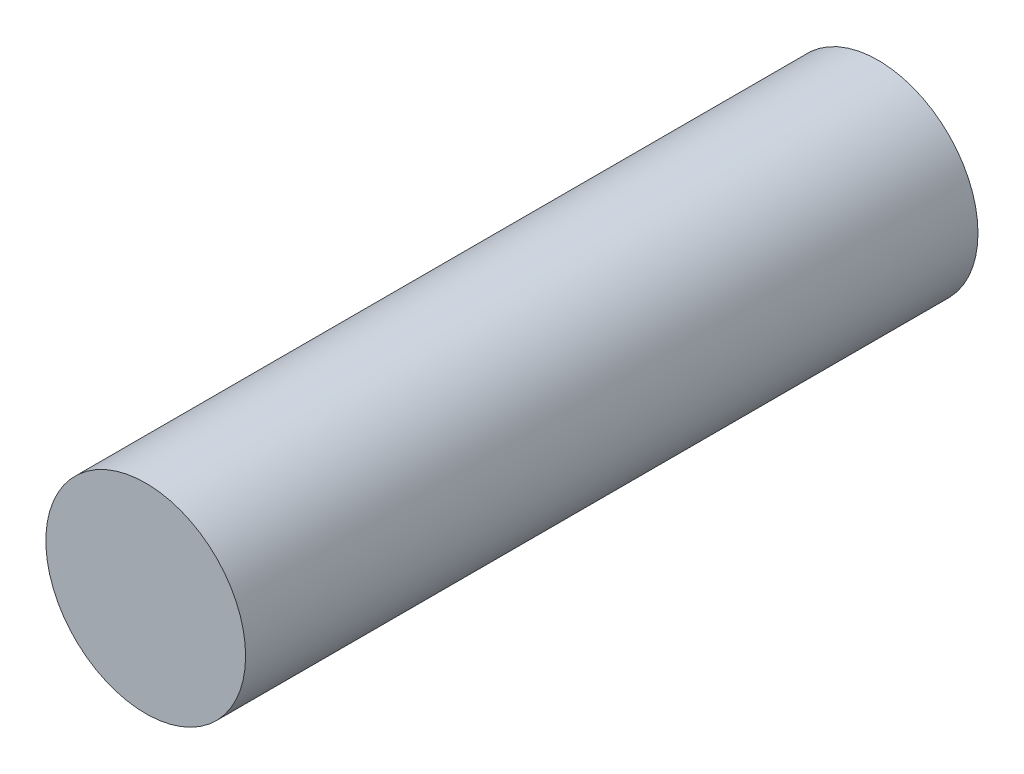
ISO-10303-21;
HEADER;
FILE_DESCRIPTION(('STEP AP214'),'2;1');
FILE_NAME('part.step','',(''),(''),'','','');
FILE_SCHEMA(('AUTOMOTIVE_DESIGN { 1 0 10303 214 1 1 1 1 }'));
ENDSEC;
DATA;
#1=APPLICATION_CONTEXT('core data for automotive mechanical design processes');
#2=APPLICATION_PROTOCOL_DEFINITION('international standard','automotive_design',2000,#1);
#3=PRODUCT_CONTEXT('',#1,'mechanical');
#4=PRODUCT('Part','Part','',(#3));
#5=PRODUCT_RELATED_PRODUCT_CATEGORY('part','',(#4));
#6=PRODUCT_DEFINITION_FORMATION('','',#4);
#7=PRODUCT_DEFINITION_CONTEXT('part definition',#1,'design');
#8=PRODUCT_DEFINITION('design','',#6,#7);
#9=PRODUCT_DEFINITION_SHAPE('','',#8);
#10=(LENGTH_UNIT() NAMED_UNIT(*) SI_UNIT(.MILLI.,.METRE.));
#11=(NAMED_UNIT(*) PLANE_ANGLE_UNIT() SI_UNIT($,.RADIAN.));
#12=(NAMED_UNIT(*) SI_UNIT($,.STERADIAN.) SOLID_ANGLE_UNIT());
#13=UNCERTAINTY_MEASURE_WITH_UNIT(LENGTH_MEASURE(1.E-05),#10,'distance_accuracy_value','');
#14=(GEOMETRIC_REPRESENTATION_CONTEXT(3) GLOBAL_UNCERTAINTY_ASSIGNED_CONTEXT((#13)) GLOBAL_UNIT_ASSIGNED_CONTEXT((#10,
#11,#12)) REPRESENTATION_CONTEXT('',''));
#15=CARTESIAN_POINT('',(0.,0.,0.));
#16=DIRECTION('',(0.,0.,1.));
#17=DIRECTION('',(1.,0.,0.));
#18=AXIS2_PLACEMENT_3D('',#15,#16,#17);
#19=CARTESIAN_POINT('',(0.,0.,44.));
#20=DIRECTION('',(0.,0.,-1.));
#21=DIRECTION('',(-1.,0.,0.));
#22=AXIS2_PLACEMENT_3D('',#19,#20,#21);
#23=CYLINDRICAL_SURFACE('',#22,6.);
#24=CARTESIAN_POINT('',(0.,0.,44.));
#25=DIRECTION('',(0.,0.,1.));
#26=DIRECTION('',(1.,0.,0.));
#27=AXIS2_PLACEMENT_3D('',#24,#25,#26);
#28=CIRCLE('',#27,6.);
#29=CARTESIAN_POINT('',(6.,0.,44.));
#30=VERTEX_POINT('',#29);
#31=EDGE_CURVE('E10',#30,#30,#28,.T.);
#32=ORIENTED_EDGE('',*,*,#31,.F.);
#33=EDGE_LOOP('',(#32));
#34=FACE_BOUND('',#33,.T.);
#35=CARTESIAN_POINT('',(0.,0.,0.));
#36=DIRECTION('',(0.,0.,1.));
#37=DIRECTION('',(1.,0.,0.));
#38=AXIS2_PLACEMENT_3D('',#35,#36,#37);
#39=CIRCLE('',#38,6.);
#40=CARTESIAN_POINT('',(6.,0.,0.));
#41=VERTEX_POINT('',#40);
#42=EDGE_CURVE('E34',#41,#41,#39,.T.);
#43=ORIENTED_EDGE('',*,*,#42,.T.);
#44=EDGE_LOOP('',(#43));
#45=FACE_BOUND('',#44,.T.);
#46=ADVANCED_FACE('F31',(#34,#45),#23,.T.);
#47=CARTESIAN_POINT('',(0.,0.,44.));
#48=DIRECTION('',(0.,0.,1.));
#49=DIRECTION('',(1.,0.,0.));
#50=AXIS2_PLACEMENT_3D('',#47,#48,#49);
#51=PLANE('',#50);
#52=ORIENTED_EDGE('',*,*,#31,.T.);
#53=EDGE_LOOP('',(#52));
#54=FACE_BOUND('',#53,.T.);
#55=ADVANCED_FACE('F46',(#54),#51,.T.);
#56=CARTESIAN_POINT('',(0.,0.,0.));
#57=DIRECTION('',(0.,0.,1.));
#58=DIRECTION('',(1.,0.,0.));
#59=AXIS2_PLACEMENT_3D('',#56,#57,#58);
#60=PLANE('',#59);
#61=ORIENTED_EDGE('',*,*,#42,.F.);
#62=EDGE_LOOP('',(#61));
#63=FACE_BOUND('',#62,.T.);
#64=ADVANCED_FACE('F44',(#63),#60,.F.);
#65=CLOSED_SHELL('',(#46,#55,#64));
#66=MANIFOLD_SOLID_BREP('B2',#65);
#67=ADVANCED_BREP_SHAPE_REPRESENTATION('',(#18,#66),#14);
#68=SHAPE_DEFINITION_REPRESENTATION(#9,#67);
ENDSEC;
END-ISO-10303-21;
